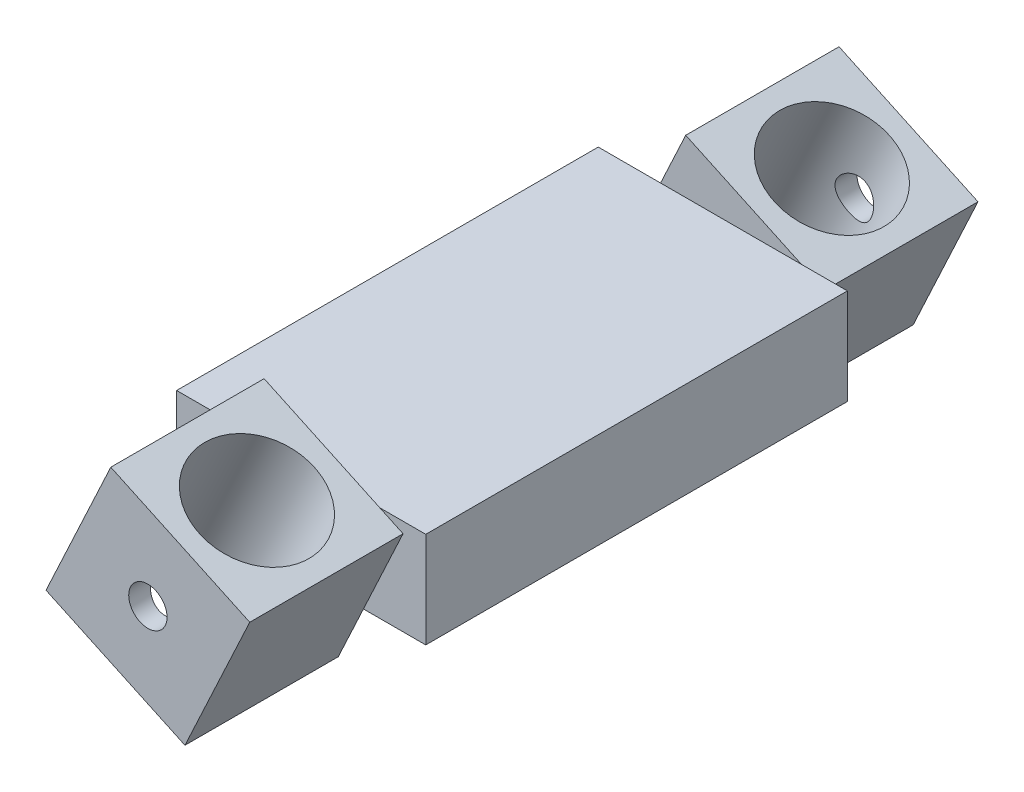
ISO-10303-21;
HEADER;
FILE_DESCRIPTION(('STEP AP214'),'2;1');
FILE_NAME('part.step','',(''),(''),'','','');
FILE_SCHEMA(('AUTOMOTIVE_DESIGN { 1 0 10303 214 1 1 1 1 }'));
ENDSEC;
DATA;
#1=APPLICATION_CONTEXT('core data for automotive mechanical design processes');
#2=APPLICATION_PROTOCOL_DEFINITION('international standard','automotive_design',2000,#1);
#3=PRODUCT_CONTEXT('',#1,'mechanical');
#4=PRODUCT('Part','Part','',(#3));
#5=PRODUCT_RELATED_PRODUCT_CATEGORY('part','',(#4));
#6=PRODUCT_DEFINITION_FORMATION('','',#4);
#7=PRODUCT_DEFINITION_CONTEXT('part definition',#1,'design');
#8=PRODUCT_DEFINITION('design','',#6,#7);
#9=PRODUCT_DEFINITION_SHAPE('','',#8);
#10=(LENGTH_UNIT() NAMED_UNIT(*) SI_UNIT(.MILLI.,.METRE.));
#11=(NAMED_UNIT(*) PLANE_ANGLE_UNIT() SI_UNIT($,.RADIAN.));
#12=(NAMED_UNIT(*) SI_UNIT($,.STERADIAN.) SOLID_ANGLE_UNIT());
#13=UNCERTAINTY_MEASURE_WITH_UNIT(LENGTH_MEASURE(1.E-05),#10,'distance_accuracy_value','');
#14=(GEOMETRIC_REPRESENTATION_CONTEXT(3) GLOBAL_UNCERTAINTY_ASSIGNED_CONTEXT((#13)) GLOBAL_UNIT_ASSIGNED_CONTEXT((#10,
#11,#12)) REPRESENTATION_CONTEXT('',''));
#15=CARTESIAN_POINT('',(0.,0.,0.));
#16=DIRECTION('',(0.,0.,1.));
#17=DIRECTION('',(1.,0.,0.));
#18=AXIS2_PLACEMENT_3D('',#15,#16,#17);
#19=CARTESIAN_POINT('',(3.38094609392562,7.25046229629318,8.));
#20=DIRECTION('',(-0.906307787036648,0.422618261740703,0.));
#21=DIRECTION('',(-0.422618261740703,-0.906307787036648,0.));
#22=AXIS2_PLACEMENT_3D('',#19,#20,#21);
#23=PLANE('',#22);
#24=DIRECTION('',(-0.422618261740703,-0.906307787036648,0.));
#25=VECTOR('',#24,1.);
#26=CARTESIAN_POINT('',(3.38094609392562,7.25046229629318,8.));
#27=LINE('',#26,#25);
#28=CARTESIAN_POINT('',(3.38094609392562,7.25046229629318,8.));
#29=VERTEX_POINT('',#28);
#30=CARTESIAN_POINT('',(1.31298442927868,2.8157041951094,8.));
#31=VERTEX_POINT('',#30);
#32=EDGE_CURVE('E133',#29,#31,#27,.T.);
#33=ORIENTED_EDGE('',*,*,#32,.T.);
#34=DIRECTION('',(0.422618261740703,0.906307787036648,0.));
#35=VECTOR('',#34,1.);
#36=CARTESIAN_POINT('',(3.38094609392562,7.25046229629318,8.));
#37=LINE('',#36,#35);
#38=CARTESIAN_POINT('',(0.,0.,8.));
#39=VERTEX_POINT('',#38);
#40=EDGE_CURVE('E85',#39,#31,#37,.T.);
#41=ORIENTED_EDGE('',*,*,#40,.F.);
#42=DIRECTION('',(0.,0.,-1.));
#43=VECTOR('',#42,1.);
#44=CARTESIAN_POINT('',(0.,0.,8.));
#45=LINE('',#44,#43);
#46=CARTESIAN_POINT('',(0.,0.,0.));
#47=VERTEX_POINT('',#46);
#48=EDGE_CURVE('E79',#39,#47,#45,.T.);
#49=ORIENTED_EDGE('',*,*,#48,.T.);
#50=DIRECTION('',(0.422618261740703,0.906307787036648,0.));
#51=VECTOR('',#50,1.);
#52=CARTESIAN_POINT('',(3.38094609392562,7.25046229629318,0.));
#53=LINE('',#52,#51);
#54=CARTESIAN_POINT('',(3.38094609392562,7.25046229629318,0.));
#55=VERTEX_POINT('',#54);
#56=EDGE_CURVE('E92',#47,#55,#53,.T.);
#57=ORIENTED_EDGE('',*,*,#56,.T.);
#58=DIRECTION('',(0.,0.,-1.));
#59=VECTOR('',#58,1.);
#60=CARTESIAN_POINT('',(3.38094609392562,7.25046229629318,8.));
#61=LINE('',#60,#59);
#62=EDGE_CURVE('E11',#29,#55,#61,.T.);
#63=ORIENTED_EDGE('',*,*,#62,.F.);
#64=EDGE_LOOP('',(#33,#41,#49,#57,#63));
#65=FACE_BOUND('',#64,.T.);
#66=ADVANCED_FACE('F39',(#65),#23,.F.);
#67=CARTESIAN_POINT('',(-3.86951620236756,10.6314083902188,8.));
#68=DIRECTION('',(-0.422618261740703,-0.906307787036648,0.));
#69=DIRECTION('',(0.906307787036648,-0.422618261740703,0.));
#70=AXIS2_PLACEMENT_3D('',#67,#68,#69);
#71=PLANE('',#70);
#72=CARTESIAN_POINT('',(-0.244285054220961,8.94093534325599,4.));
#73=DIRECTION('',(0.422618261740703,0.906307787036648,0.));
#74=DIRECTION('',(-0.906307787036648,0.422618261740703,0.));
#75=AXIS2_PLACEMENT_3D('',#72,#73,#74);
#76=CIRCLE('',#75,3.);
#77=CARTESIAN_POINT('',(-2.96320841533091,10.2087901284781,4.));
#78=VERTEX_POINT('',#77);
#79=EDGE_CURVE('E374',#78,#78,#76,.T.);
#80=ORIENTED_EDGE('',*,*,#79,.F.);
#81=EDGE_LOOP('',(#80));
#82=FACE_BOUND('',#81,.T.);
#83=DIRECTION('',(0.906307787036648,-0.422618261740703,0.));
#84=VECTOR('',#83,1.);
#85=CARTESIAN_POINT('',(2.16878093015228,7.8157041951094,8.));
#86=LINE('',#85,#84);
#87=CARTESIAN_POINT('',(2.16878093015228,7.8157041951094,8.));
#88=VERTEX_POINT('',#87);
#89=EDGE_CURVE('E130',#88,#29,#86,.T.);
#90=ORIENTED_EDGE('',*,*,#89,.T.);
#91=ORIENTED_EDGE('',*,*,#62,.T.);
#92=DIRECTION('',(-0.906307787036648,0.422618261740703,0.));
#93=VECTOR('',#92,1.);
#94=CARTESIAN_POINT('',(-3.86951620236756,10.6314083902188,0.));
#95=LINE('',#94,#93);
#96=CARTESIAN_POINT('',(-3.86951620236756,10.6314083902188,0.));
#97=VERTEX_POINT('',#96);
#98=EDGE_CURVE('E97',#55,#97,#95,.T.);
#99=ORIENTED_EDGE('',*,*,#98,.T.);
#100=DIRECTION('',(0.,0.,-1.));
#101=VECTOR('',#100,1.);
#102=CARTESIAN_POINT('',(-3.86951620236756,10.6314083902188,8.));
#103=LINE('',#102,#101);
#104=CARTESIAN_POINT('',(-3.86951620236756,10.6314083902188,8.));
#105=VERTEX_POINT('',#104);
#106=EDGE_CURVE('E48',#105,#97,#103,.T.);
#107=ORIENTED_EDGE('',*,*,#106,.F.);
#108=DIRECTION('',(-0.906307787036648,0.422618261740703,0.));
#109=VECTOR('',#108,1.);
#110=CARTESIAN_POINT('',(-3.86951620236756,10.6314083902188,8.));
#111=LINE('',#110,#109);
#112=EDGE_CURVE('E127',#88,#105,#111,.T.);
#113=ORIENTED_EDGE('',*,*,#112,.F.);
#114=EDGE_LOOP('',(#90,#91,#99,#107,#113));
#115=FACE_BOUND('',#114,.T.);
#116=ADVANCED_FACE('F125',(#82,#115),#71,.F.);
#117=CARTESIAN_POINT('',(-7.25046229629319,3.38094609392563,8.));
#118=DIRECTION('',(0.906307787036648,-0.422618261740704,0.));
#119=DIRECTION('',(0.422618261740704,0.906307787036648,0.));
#120=AXIS2_PLACEMENT_3D('',#117,#118,#119);
#121=PLANE('',#120);
#122=DIRECTION('',(0.422618261740704,0.906307787036648,0.));
#123=VECTOR('',#122,1.);
#124=CARTESIAN_POINT('',(-7.25046229629319,3.38094609392563,8.));
#125=LINE('',#124,#123);
#126=CARTESIAN_POINT('',(-7.25046229629319,3.38094609392563,8.));
#127=VERTEX_POINT('',#126);
#128=CARTESIAN_POINT('',(-5.18250063164625,7.8157041951094,8.));
#129=VERTEX_POINT('',#128);
#130=EDGE_CURVE('E172',#127,#129,#125,.T.);
#131=ORIENTED_EDGE('',*,*,#130,.T.);
#132=DIRECTION('',(-0.422618261740704,-0.906307787036648,0.));
#133=VECTOR('',#132,1.);
#134=CARTESIAN_POINT('',(-7.25046229629319,3.38094609392563,8.));
#135=LINE('',#134,#133);
#136=EDGE_CURVE('E121',#105,#129,#135,.T.);
#137=ORIENTED_EDGE('',*,*,#136,.F.);
#138=ORIENTED_EDGE('',*,*,#106,.T.);
#139=DIRECTION('',(-0.422618261740704,-0.906307787036648,0.));
#140=VECTOR('',#139,1.);
#141=CARTESIAN_POINT('',(-7.25046229629319,3.38094609392563,0.));
#142=LINE('',#141,#140);
#143=CARTESIAN_POINT('',(-7.25046229629319,3.38094609392563,0.));
#144=VERTEX_POINT('',#143);
#145=EDGE_CURVE('E86',#97,#144,#142,.T.);
#146=ORIENTED_EDGE('',*,*,#145,.T.);
#147=DIRECTION('',(0.,0.,-1.));
#148=VECTOR('',#147,1.);
#149=CARTESIAN_POINT('',(-7.25046229629319,3.38094609392563,8.));
#150=LINE('',#149,#148);
#151=EDGE_CURVE('E73',#127,#144,#150,.T.);
#152=ORIENTED_EDGE('',*,*,#151,.F.);
#153=EDGE_LOOP('',(#131,#137,#138,#146,#152));
#154=FACE_BOUND('',#153,.T.);
#155=ADVANCED_FACE('F119',(#154),#121,.F.);
#156=CARTESIAN_POINT('',(0.,0.,8.));
#157=DIRECTION('',(0.422618261740703,0.906307787036648,0.));
#158=DIRECTION('',(-0.906307787036648,0.422618261740703,0.));
#159=AXIS2_PLACEMENT_3D('',#156,#157,#158);
#160=PLANE('',#159);
#161=CARTESIAN_POINT('',(-3.62523114814659,1.69047304696281,4.));
#162=DIRECTION('',(0.422618261740703,0.906307787036648,0.));
#163=DIRECTION('',(-0.906307787036648,0.422618261740703,0.));
#164=AXIS2_PLACEMENT_3D('',#161,#162,#163);
#165=CIRCLE('',#164,3.);
#166=CARTESIAN_POINT('',(-6.34415450925653,2.95832783218492,4.));
#167=VERTEX_POINT('',#166);
#168=EDGE_CURVE('E362',#167,#167,#165,.F.);
#169=ORIENTED_EDGE('',*,*,#168,.F.);
#170=EDGE_LOOP('',(#169));
#171=FACE_BOUND('',#170,.T.);
#172=DIRECTION('',(-0.906307787036648,0.422618261740703,0.));
#173=VECTOR('',#172,1.);
#174=CARTESIAN_POINT('',(-6.03829713251985,2.8157041951094,8.));
#175=LINE('',#174,#173);
#176=CARTESIAN_POINT('',(-6.03829713251985,2.8157041951094,8.));
#177=VERTEX_POINT('',#176);
#178=EDGE_CURVE('E218',#177,#127,#175,.T.);
#179=ORIENTED_EDGE('',*,*,#178,.T.);
#180=ORIENTED_EDGE('',*,*,#151,.T.);
#181=DIRECTION('',(0.906307787036648,-0.422618261740703,0.));
#182=VECTOR('',#181,1.);
#183=CARTESIAN_POINT('',(0.,0.,0.));
#184=LINE('',#183,#182);
#185=EDGE_CURVE('E76',#144,#47,#184,.T.);
#186=ORIENTED_EDGE('',*,*,#185,.T.);
#187=ORIENTED_EDGE('',*,*,#48,.F.);
#188=DIRECTION('',(0.906307787036648,-0.422618261740703,0.));
#189=VECTOR('',#188,1.);
#190=CARTESIAN_POINT('',(0.,0.,8.));
#191=LINE('',#190,#189);
#192=EDGE_CURVE('E56',#177,#39,#191,.T.);
#193=ORIENTED_EDGE('',*,*,#192,.F.);
#194=EDGE_LOOP('',(#179,#180,#186,#187,#193));
#195=FACE_BOUND('',#194,.T.);
#196=ADVANCED_FACE('F78',(#171,#195),#160,.F.);
#197=CARTESIAN_POINT('',(0.,0.,8.));
#198=DIRECTION('',(0.,0.,-1.));
#199=DIRECTION('',(-1.,0.,0.));
#200=AXIS2_PLACEMENT_3D('',#197,#198,#199);
#201=PLANE('',#200);
#202=DIRECTION('',(-1.,0.,0.));
#203=VECTOR('',#202,1.);
#204=CARTESIAN_POINT('',(2.16878093015228,7.8157041951094,8.));
#205=LINE('',#204,#203);
#206=EDGE_CURVE('E99',#88,#129,#205,.T.);
#207=ORIENTED_EDGE('',*,*,#206,.F.);
#208=ORIENTED_EDGE('',*,*,#112,.T.);
#209=ORIENTED_EDGE('',*,*,#136,.T.);
#210=EDGE_LOOP('',(#207,#208,#209));
#211=FACE_BOUND('',#210,.T.);
#212=ADVANCED_FACE('F185',(#211),#201,.F.);
#213=DIRECTION('',(1.,0.,0.));
#214=VECTOR('',#213,1.);
#215=CARTESIAN_POINT('',(-6.03829713251985,2.8157041951094,8.));
#216=LINE('',#215,#214);
#217=EDGE_CURVE('E105',#177,#31,#216,.T.);
#218=ORIENTED_EDGE('',*,*,#217,.F.);
#219=ORIENTED_EDGE('',*,*,#192,.T.);
#220=ORIENTED_EDGE('',*,*,#40,.T.);
#221=EDGE_LOOP('',(#218,#219,#220));
#222=FACE_BOUND('',#221,.T.);
#223=ADVANCED_FACE('F238',(#222),#201,.F.);
#224=CARTESIAN_POINT('',(0.,0.,0.));
#225=DIRECTION('',(0.,0.,-1.));
#226=DIRECTION('',(-1.,0.,0.));
#227=AXIS2_PLACEMENT_3D('',#224,#225,#226);
#228=PLANE('',#227);
#229=CARTESIAN_POINT('',(-1.93475810118378,5.3157041951094,0.));
#230=DIRECTION('',(0.,0.,-1.));
#231=DIRECTION('',(-1.,0.,0.));
#232=AXIS2_PLACEMENT_3D('',#229,#230,#231);
#233=CIRCLE('',#232,1.);
#234=CARTESIAN_POINT('',(-2.93475810118378,5.3157041951094,0.));
#235=VERTEX_POINT('',#234);
#236=EDGE_CURVE('E201',#235,#235,#233,.T.);
#237=ORIENTED_EDGE('',*,*,#236,.F.);
#238=EDGE_LOOP('',(#237));
#239=FACE_BOUND('',#238,.T.);
#240=ORIENTED_EDGE('',*,*,#56,.F.);
#241=ORIENTED_EDGE('',*,*,#185,.F.);
#242=ORIENTED_EDGE('',*,*,#145,.F.);
#243=ORIENTED_EDGE('',*,*,#98,.F.);
#244=EDGE_LOOP('',(#240,#241,#242,#243));
#245=FACE_BOUND('',#244,.T.);
#246=ADVANCED_FACE('F96',(#239,#245),#228,.T.);
#247=CARTESIAN_POINT('',(-6.03829713251985,2.8157041951094,19.));
#248=DIRECTION('',(0.,1.,0.));
#249=DIRECTION('',(-1.,0.,0.));
#250=AXIS2_PLACEMENT_3D('',#247,#248,#249);
#251=PLANE('',#250);
#252=ORIENTED_EDGE('',*,*,#217,.T.);
#253=DIRECTION('',(1.,0.,0.));
#254=VECTOR('',#253,1.);
#255=CARTESIAN_POINT('',(1.31298442927868,2.8157041951094,8.));
#256=LINE('',#255,#254);
#257=CARTESIAN_POINT('',(4.56524189881622,2.8157041951094,8.));
#258=VERTEX_POINT('',#257);
#259=EDGE_CURVE('E208',#31,#258,#256,.T.);
#260=ORIENTED_EDGE('',*,*,#259,.T.);
#261=DIRECTION('',(0.,0.,-1.));
#262=VECTOR('',#261,1.);
#263=CARTESIAN_POINT('',(4.56524189881622,2.8157041951094,24.9646608158522));
#264=LINE('',#263,#262);
#265=CARTESIAN_POINT('',(4.56524189881622,2.8157041951094,30.));
#266=VERTEX_POINT('',#265);
#267=EDGE_CURVE('E207',#266,#258,#264,.T.);
#268=ORIENTED_EDGE('',*,*,#267,.F.);
#269=DIRECTION('',(1.,0.,0.));
#270=VECTOR('',#269,1.);
#271=CARTESIAN_POINT('',(1.31298442927868,2.8157041951094,30.));
#272=LINE('',#271,#270);
#273=CARTESIAN_POINT('',(1.31298442927868,2.8157041951094,30.));
#274=VERTEX_POINT('',#273);
#275=EDGE_CURVE('E705',#274,#266,#272,.T.);
#276=ORIENTED_EDGE('',*,*,#275,.F.);
#277=DIRECTION('',(1.,0.,0.));
#278=VECTOR('',#277,1.);
#279=CARTESIAN_POINT('',(-6.03829713251985,2.8157041951094,30.));
#280=LINE('',#279,#278);
#281=CARTESIAN_POINT('',(-6.03829713251985,2.8157041951094,30.));
#282=VERTEX_POINT('',#281);
#283=EDGE_CURVE('E317',#282,#274,#280,.T.);
#284=ORIENTED_EDGE('',*,*,#283,.F.);
#285=DIRECTION('',(1.,0.,0.));
#286=VECTOR('',#285,1.);
#287=CARTESIAN_POINT('',(-6.03829713251985,2.8157041951094,30.));
#288=LINE('',#287,#286);
#289=CARTESIAN_POINT('',(-8.43475810118378,2.8157041951094,30.));
#290=VERTEX_POINT('',#289);
#291=EDGE_CURVE('E247',#290,#282,#288,.T.);
#292=ORIENTED_EDGE('',*,*,#291,.F.);
#293=DIRECTION('',(0.,0.,-1.));
#294=VECTOR('',#293,1.);
#295=CARTESIAN_POINT('',(-8.43475810118378,2.8157041951094,24.9646608158522));
#296=LINE('',#295,#294);
#297=CARTESIAN_POINT('',(-8.43475810118378,2.8157041951094,8.));
#298=VERTEX_POINT('',#297);
#299=EDGE_CURVE('E224',#290,#298,#296,.T.);
#300=ORIENTED_EDGE('',*,*,#299,.T.);
#301=DIRECTION('',(1.,0.,0.));
#302=VECTOR('',#301,1.);
#303=CARTESIAN_POINT('',(-6.03829713251985,2.8157041951094,8.));
#304=LINE('',#303,#302);
#305=EDGE_CURVE('E221',#298,#177,#304,.T.);
#306=ORIENTED_EDGE('',*,*,#305,.T.);
#307=EDGE_LOOP('',(#252,#260,#268,#276,#284,#292,#300,#306));
#308=FACE_BOUND('',#307,.T.);
#309=ADVANCED_FACE('F240',(#308),#251,.F.);
#310=CARTESIAN_POINT('',(2.16878093015228,7.8157041951094,19.));
#311=DIRECTION('',(0.,-1.,0.));
#312=DIRECTION('',(0.,0.,-1.));
#313=AXIS2_PLACEMENT_3D('',#310,#311,#312);
#314=PLANE('',#313);
#315=ORIENTED_EDGE('',*,*,#206,.T.);
#316=DIRECTION('',(-1.,0.,0.));
#317=VECTOR('',#316,1.);
#318=CARTESIAN_POINT('',(-5.18250063164625,7.8157041951094,8.));
#319=LINE('',#318,#317);
#320=CARTESIAN_POINT('',(-8.43475810118378,7.8157041951094,8.));
#321=VERTEX_POINT('',#320);
#322=EDGE_CURVE('E169',#129,#321,#319,.T.);
#323=ORIENTED_EDGE('',*,*,#322,.T.);
#324=DIRECTION('',(0.,0.,-1.));
#325=VECTOR('',#324,1.);
#326=CARTESIAN_POINT('',(-8.43475810118378,7.8157041951094,24.9646608158522));
#327=LINE('',#326,#325);
#328=CARTESIAN_POINT('',(-8.43475810118378,7.8157041951094,30.));
#329=VERTEX_POINT('',#328);
#330=EDGE_CURVE('E179',#329,#321,#327,.T.);
#331=ORIENTED_EDGE('',*,*,#330,.F.);
#332=DIRECTION('',(-1.,0.,0.));
#333=VECTOR('',#332,1.);
#334=CARTESIAN_POINT('',(-5.18250063164625,7.8157041951094,30.));
#335=LINE('',#334,#333);
#336=CARTESIAN_POINT('',(-5.18250063164625,7.8157041951094,30.));
#337=VERTEX_POINT('',#336);
#338=EDGE_CURVE('E258',#337,#329,#335,.T.);
#339=ORIENTED_EDGE('',*,*,#338,.F.);
#340=DIRECTION('',(-1.,0.,0.));
#341=VECTOR('',#340,1.);
#342=CARTESIAN_POINT('',(2.16878093015228,7.8157041951094,30.));
#343=LINE('',#342,#341);
#344=CARTESIAN_POINT('',(2.16878093015228,7.8157041951094,30.));
#345=VERTEX_POINT('',#344);
#346=EDGE_CURVE('E312',#345,#337,#343,.T.);
#347=ORIENTED_EDGE('',*,*,#346,.F.);
#348=DIRECTION('',(-1.,0.,0.));
#349=VECTOR('',#348,1.);
#350=CARTESIAN_POINT('',(4.56524189881622,7.8157041951094,30.));
#351=LINE('',#350,#349);
#352=CARTESIAN_POINT('',(4.56524189881622,7.8157041951094,30.));
#353=VERTEX_POINT('',#352);
#354=EDGE_CURVE('E693',#353,#345,#351,.T.);
#355=ORIENTED_EDGE('',*,*,#354,.F.);
#356=DIRECTION('',(0.,0.,-1.));
#357=VECTOR('',#356,1.);
#358=CARTESIAN_POINT('',(4.56524189881622,7.8157041951094,24.9646608158522));
#359=LINE('',#358,#357);
#360=CARTESIAN_POINT('',(4.56524189881622,7.8157041951094,8.));
#361=VERTEX_POINT('',#360);
#362=EDGE_CURVE('E192',#353,#361,#359,.T.);
#363=ORIENTED_EDGE('',*,*,#362,.T.);
#364=DIRECTION('',(-1.,0.,0.));
#365=VECTOR('',#364,1.);
#366=CARTESIAN_POINT('',(4.56524189881622,7.8157041951094,8.));
#367=LINE('',#366,#365);
#368=EDGE_CURVE('E189',#361,#88,#367,.T.);
#369=ORIENTED_EDGE('',*,*,#368,.T.);
#370=EDGE_LOOP('',(#315,#323,#331,#339,#347,#355,#363,#369));
#371=FACE_BOUND('',#370,.T.);
#372=ADVANCED_FACE('F187',(#371),#314,.F.);
#373=CARTESIAN_POINT('',(-8.43475810118378,2.8157041951094,24.9646608158522));
#374=DIRECTION('',(1.,0.,0.));
#375=DIRECTION('',(0.,0.,-1.));
#376=AXIS2_PLACEMENT_3D('',#373,#374,#375);
#377=PLANE('',#376);
#378=ORIENTED_EDGE('',*,*,#299,.F.);
#379=DIRECTION('',(0.,-1.,0.));
#380=VECTOR('',#379,1.);
#381=CARTESIAN_POINT('',(-8.43475810118378,2.8157041951094,30.));
#382=LINE('',#381,#380);
#383=EDGE_CURVE('E253',#329,#290,#382,.T.);
#384=ORIENTED_EDGE('',*,*,#383,.F.);
#385=ORIENTED_EDGE('',*,*,#330,.T.);
#386=DIRECTION('',(0.,-1.,0.));
#387=VECTOR('',#386,1.);
#388=CARTESIAN_POINT('',(-8.43475810118378,2.8157041951094,8.));
#389=LINE('',#388,#387);
#390=EDGE_CURVE('E175',#321,#298,#389,.T.);
#391=ORIENTED_EDGE('',*,*,#390,.T.);
#392=EDGE_LOOP('',(#378,#384,#385,#391));
#393=FACE_BOUND('',#392,.T.);
#394=ADVANCED_FACE('F251',(#393),#377,.F.);
#395=CARTESIAN_POINT('',(0.,0.,8.));
#396=DIRECTION('',(0.,0.,1.));
#397=DIRECTION('',(1.,0.,0.));
#398=AXIS2_PLACEMENT_3D('',#395,#396,#397);
#399=PLANE('',#398);
#400=ORIENTED_EDGE('',*,*,#130,.F.);
#401=ORIENTED_EDGE('',*,*,#178,.F.);
#402=ORIENTED_EDGE('',*,*,#305,.F.);
#403=ORIENTED_EDGE('',*,*,#390,.F.);
#404=ORIENTED_EDGE('',*,*,#322,.F.);
#405=EDGE_LOOP('',(#400,#401,#402,#403,#404));
#406=FACE_BOUND('',#405,.T.);
#407=ADVANCED_FACE('F170',(#406),#399,.F.);
#408=CARTESIAN_POINT('',(4.56524189881622,2.8157041951094,24.9646608158522));
#409=DIRECTION('',(-1.,0.,0.));
#410=DIRECTION('',(0.,0.,1.));
#411=AXIS2_PLACEMENT_3D('',#408,#409,#410);
#412=PLANE('',#411);
#413=ORIENTED_EDGE('',*,*,#362,.F.);
#414=DIRECTION('',(0.,1.,0.));
#415=VECTOR('',#414,1.);
#416=CARTESIAN_POINT('',(4.56524189881622,2.8157041951094,30.));
#417=LINE('',#416,#415);
#418=EDGE_CURVE('E699',#266,#353,#417,.T.);
#419=ORIENTED_EDGE('',*,*,#418,.F.);
#420=ORIENTED_EDGE('',*,*,#267,.T.);
#421=DIRECTION('',(0.,1.,0.));
#422=VECTOR('',#421,1.);
#423=CARTESIAN_POINT('',(4.56524189881622,2.8157041951094,8.));
#424=LINE('',#423,#422);
#425=EDGE_CURVE('E204',#258,#361,#424,.T.);
#426=ORIENTED_EDGE('',*,*,#425,.T.);
#427=EDGE_LOOP('',(#413,#419,#420,#426));
#428=FACE_BOUND('',#427,.T.);
#429=ADVANCED_FACE('F446',(#428),#412,.F.);
#430=CARTESIAN_POINT('',(0.,0.,8.));
#431=DIRECTION('',(0.,0.,1.));
#432=DIRECTION('',(1.,0.,0.));
#433=AXIS2_PLACEMENT_3D('',#430,#431,#432);
#434=PLANE('',#433);
#435=ORIENTED_EDGE('',*,*,#32,.F.);
#436=ORIENTED_EDGE('',*,*,#89,.F.);
#437=ORIENTED_EDGE('',*,*,#368,.F.);
#438=ORIENTED_EDGE('',*,*,#425,.F.);
#439=ORIENTED_EDGE('',*,*,#259,.F.);
#440=EDGE_LOOP('',(#435,#436,#437,#438,#439));
#441=FACE_BOUND('',#440,.T.);
#442=ADVANCED_FACE('F197',(#441),#434,.F.);
#443=CARTESIAN_POINT('',(-1.93475810118378,5.3157041951094,4.));
#444=DIRECTION('',(0.,0.,-1.));
#445=DIRECTION('',(-1.,0.,0.));
#446=AXIS2_PLACEMENT_3D('',#443,#444,#445);
#447=CYLINDRICAL_SURFACE('',#446,1.);
#448=CARTESIAN_POINT('',(-2.93475810118378,5.3157041951094,1.14017374738312));
#449=CARTESIAN_POINT('',(-2.93475864990779,5.36917819681442,1.14733553557993));
#450=CARTESIAN_POINT('',(-2.93046120091182,5.42277127116053,1.15356858443858));
#451=CARTESIAN_POINT('',(-2.91326425363279,5.52878994586253,1.16346284797238));
#452=CARTESIAN_POINT('',(-2.90036987198543,5.581216221494,1.16712558975711));
#453=CARTESIAN_POINT('',(-2.86623014781804,5.68349540957464,1.17143631815716));
#454=CARTESIAN_POINT('',(-2.84497297085371,5.73334456145468,1.17208001567776));
#455=CARTESIAN_POINT('',(-2.79471685993221,5.82891576397315,1.17025915090065));
#456=CARTESIAN_POINT('',(-2.76571721747062,5.87463743639788,1.16779430406659));
#457=CARTESIAN_POINT('',(-2.70138356625217,5.95998505251699,1.16012626346611));
#458=CARTESIAN_POINT('',(-2.66615529292929,5.99969487369932,1.15496633407373));
#459=CARTESIAN_POINT('',(-2.59007380416502,6.07290307665939,1.14252894985464));
#460=CARTESIAN_POINT('',(-2.54921945814865,6.10640020679643,1.13525106909164));
#461=CARTESIAN_POINT('',(-2.46130043818123,6.16760203289099,1.11905383039535));
#462=CARTESIAN_POINT('',(-2.4140589879412,6.19503884318024,1.1100826835325));
#463=CARTESIAN_POINT('',(-2.31581924083264,6.24185485143122,1.09165740987211));
#464=CARTESIAN_POINT('',(-2.2648198804218,6.26123175793465,1.08220314657955));
#465=CARTESIAN_POINT('',(-2.15793874439207,6.29213618765834,1.06337182842357));
#466=CARTESIAN_POINT('',(-2.10194074787957,6.30327754263592,1.05401678735724));
#467=CARTESIAN_POINT('',(-1.98862432210548,6.31587766203998,1.03687369396259));
#468=CARTESIAN_POINT('',(-1.9313060236186,6.3173373813206,1.02908548717826));
#469=CARTESIAN_POINT('',(-1.81778716589613,6.31044246446438,1.01604942064311));
#470=CARTESIAN_POINT('',(-1.76158230011514,6.30222704492345,1.01076702347563));
#471=CARTESIAN_POINT('',(-1.65119283199194,6.27632992630914,1.0031860499227));
#472=CARTESIAN_POINT('',(-1.59700752802854,6.25865154820178,1.00088642771966));
#473=CARTESIAN_POINT('',(-1.49485374122448,6.2153799113696,0.999568508284584));
#474=CARTESIAN_POINT('',(-1.44671284559449,6.1901970031326,1.00040129287356));
#475=CARTESIAN_POINT('',(-1.35523611627108,6.1324535894443,1.00492650105571));
#476=CARTESIAN_POINT('',(-1.31190008268957,6.09989339106887,1.00861880563832));
#477=CARTESIAN_POINT('',(-1.23157221921439,6.02871498272164,1.01842790103737));
#478=CARTESIAN_POINT('',(-1.19452622201755,5.99015462534658,1.02452231263632));
#479=CARTESIAN_POINT('',(-1.1271644869485,5.90783824394151,1.03852551241755));
#480=CARTESIAN_POINT('',(-1.09685014759119,5.86408114317068,1.0464346769256));
#481=CARTESIAN_POINT('',(-1.04250931769223,5.77060305287296,1.06364607324206));
#482=CARTESIAN_POINT('',(-1.01879011655407,5.72071149933357,1.07299200039939));
#483=CARTESIAN_POINT('',(-0.979869221656484,5.61772913528381,1.09185240487969));
#484=CARTESIAN_POINT('',(-0.964669965167039,5.56463741411859,1.10136692963058));
#485=CARTESIAN_POINT('',(-0.942819603857798,5.45465630473434,1.11986801715037));
#486=CARTESIAN_POINT('',(-0.936481962820007,5.3976990830844,1.1288249835745));
#487=CARTESIAN_POINT('',(-0.933648172110955,5.28326083897813,1.14475404878013));
#488=CARTESIAN_POINT('',(-0.937149690163241,5.22577994387297,1.15172661751222));
#489=CARTESIAN_POINT('',(-0.953818565255692,5.11348067255937,1.16263448681165));
#490=CARTESIAN_POINT('',(-0.9667308482968,5.05863197534959,1.16664442166105));
#491=CARTESIAN_POINT('',(-1.00164234573636,4.95176493054454,1.17138570082086));
#492=CARTESIAN_POINT('',(-1.02363823971457,4.89974555657456,1.17211824199202));
#493=CARTESIAN_POINT('',(-1.07472446724624,4.80267259698163,1.1702566580584));
#494=CARTESIAN_POINT('',(-1.10340929769589,4.75740158064745,1.16782555994089));
#495=CARTESIAN_POINT('',(-1.16749437993188,4.67215906718952,1.16021719526934));
#496=CARTESIAN_POINT('',(-1.20289518060273,4.6321880036756,1.15503970419524));
#497=CARTESIAN_POINT('',(-1.27965136228827,4.55827787667292,1.14249756315251));
#498=CARTESIAN_POINT('',(-1.3210465872892,4.52438287089812,1.13511789683461));
#499=CARTESIAN_POINT('',(-1.40851835684369,4.46370232231959,1.11899292703232));
#500=CARTESIAN_POINT('',(-1.45459619565347,4.43691875251955,1.11024724562606));
#501=CARTESIAN_POINT('',(-1.55284044146405,4.38982168603956,1.09181499362265));
#502=CARTESIAN_POINT('',(-1.60519901520622,4.36991817245228,1.08210314145819));
#503=CARTESIAN_POINT('',(-1.71259710491996,4.33909458964935,1.06320399544024));
#504=CARTESIAN_POINT('',(-1.76763703516122,4.32817591328352,1.05401678312296));
#505=CARTESIAN_POINT('',(-1.88003805090925,4.31557367055957,1.03699355327296));
#506=CARTESIAN_POINT('',(-1.93742322251253,4.31406409313114,1.02918557236344));
#507=CARTESIAN_POINT('',(-2.0518820875337,4.32093487732268,1.01602226815266));
#508=CARTESIAN_POINT('',(-2.10895587429588,4.32931209059733,1.0106661648302));
#509=CARTESIAN_POINT('',(-2.21879855819315,4.35529819718839,1.00318386718311));
#510=CARTESIAN_POINT('',(-2.27164846546296,4.3725301813795,1.00093867895183));
#511=CARTESIAN_POINT('',(-2.3737928479915,4.41552793757022,0.99954022574925));
#512=CARTESIAN_POINT('',(-2.42308805873437,4.44129193804875,1.00038631929397));
#513=CARTESIAN_POINT('',(-2.51499675212469,4.4995056999125,1.00499083149581));
#514=CARTESIAN_POINT('',(-2.55778297067106,4.53169182960197,1.00864695859773));
#515=CARTESIAN_POINT('',(-2.6375304601626,4.60229821256565,1.01836967892051));
#516=CARTESIAN_POINT('',(-2.67449151411808,4.64071869796392,1.02443636190591));
#517=CARTESIAN_POINT('',(-2.74237749751609,4.72352736296213,1.03851313776915));
#518=CARTESIAN_POINT('',(-2.77317073493308,4.76801726325302,1.04655880502516));
#519=CARTESIAN_POINT('',(-2.8271448237788,4.86122667371555,1.06372668726133));
#520=CARTESIAN_POINT('',(-2.85032108365637,4.90994871275261,1.07284954709157));
#521=CARTESIAN_POINT('',(-2.89093000128599,5.01672362354841,1.09241581231923));
#522=CARTESIAN_POINT('',(-2.90728990420165,5.07518335923296,1.10288234786801));
#523=CARTESIAN_POINT('',(-2.92920245079895,5.19427915677427,1.12269041683085));
#524=CARTESIAN_POINT('',(-2.93475747739213,5.25491473576476,1.13203219787226));
#525=CARTESIAN_POINT('',(-2.93475810118378,5.3157041951094,1.14017374738312));
#526=B_SPLINE_CURVE_WITH_KNOTS('',3,(#448,#449,#450,#451,#452,#453,#454,#455,#456,#457,#458,
#459,#460,#461,#462,#463,#464,#465,#466,#467,#468,#469,#470,#471,#472,#473,#474,#475,#476,#477,
#478,#479,#480,#481,#482,#483,#484,#485,#486,#487,#488,#489,#490,#491,#492,#493,#494,#495,#496,
#497,#498,#499,#500,#501,#502,#503,#504,#505,#506,#507,#508,#509,#510,#511,#512,#513,#514,#515,
#516,#517,#518,#519,#520,#521,#522,#523,#524,#525),.UNSPECIFIED.,.T.,.F.,(4,2,2,2,2,2,2,2,2,2,2,
2,2,2,2,2,2,2,2,2,2,2,2,2,2,2,2,2,2,2,2,2,2,2,2,2,2,2,4),(0.,0.161655015818573,
0.323213905219895,0.485002248663138,0.646805402255713,0.80608751208361,0.965401676930054,
1.1307583761686,1.29616205480478,1.46890026673539,1.64162144205609,1.81188737714579,
1.98209359761065,2.14431257632067,2.30652480399007,2.46726020816788,2.62802897425961,
2.7953622930033,2.9627434557919,3.13590731952647,3.30903013992319,3.47762724183347,
3.64616276928729,3.80634792018175,3.96654616837313,4.12786276922688,4.28922407925877,
4.4589956359671,4.62879350609124,4.80172211039915,4.97459566225268,5.14065491195209,
5.30667970400402,5.46693141596756,5.62718909596036,5.79057036808667,5.95404994736616,
6.13786055916769,6.32163062870857),.UNSPECIFIED.);
#527=CARTESIAN_POINT('',(-2.93475810118378,5.3157041951094,1.14017374738312));
#528=VERTEX_POINT('',#527);
#529=EDGE_CURVE('E366',#528,#528,#526,.T.);
#530=ORIENTED_EDGE('',*,*,#529,.F.);
#531=EDGE_LOOP('',(#530));
#532=FACE_BOUND('',#531,.T.);
#533=ORIENTED_EDGE('',*,*,#236,.T.);
#534=EDGE_LOOP('',(#533));
#535=FACE_BOUND('',#534,.T.);
#536=ADVANCED_FACE('F334',(#532,#535),#447,.F.);
#537=CARTESIAN_POINT('',(3.38094609392562,7.25046229629318,30.));
#538=DIRECTION('',(-0.906307787036648,0.422618261740703,0.));
#539=DIRECTION('',(-0.422618261740703,-0.906307787036648,0.));
#540=AXIS2_PLACEMENT_3D('',#537,#538,#539);
#541=PLANE('',#540);
#542=DIRECTION('',(-0.422618261740703,-0.906307787036648,0.));
#543=VECTOR('',#542,1.);
#544=CARTESIAN_POINT('',(3.38094609392562,7.25046229629318,30.));
#545=LINE('',#544,#543);
#546=CARTESIAN_POINT('',(3.38094609392562,7.25046229629318,30.));
#547=VERTEX_POINT('',#546);
#548=EDGE_CURVE('E371',#547,#274,#545,.T.);
#549=ORIENTED_EDGE('',*,*,#548,.F.);
#550=DIRECTION('',(0.,0.,1.));
#551=VECTOR('',#550,1.);
#552=CARTESIAN_POINT('',(3.38094609392562,7.25046229629318,30.));
#553=LINE('',#552,#551);
#554=CARTESIAN_POINT('',(3.38094609392562,7.25046229629318,38.));
#555=VERTEX_POINT('',#554);
#556=EDGE_CURVE('E309',#547,#555,#553,.T.);
#557=ORIENTED_EDGE('',*,*,#556,.T.);
#558=DIRECTION('',(0.422618261740703,0.906307787036648,0.));
#559=VECTOR('',#558,1.);
#560=CARTESIAN_POINT('',(3.38094609392562,7.25046229629318,38.));
#561=LINE('',#560,#559);
#562=CARTESIAN_POINT('',(0.,0.,38.));
#563=VERTEX_POINT('',#562);
#564=EDGE_CURVE('E287',#563,#555,#561,.T.);
#565=ORIENTED_EDGE('',*,*,#564,.F.);
#566=DIRECTION('',(0.,0.,1.));
#567=VECTOR('',#566,1.);
#568=CARTESIAN_POINT('',(0.,0.,30.));
#569=LINE('',#568,#567);
#570=CARTESIAN_POINT('',(0.,0.,30.));
#571=VERTEX_POINT('',#570);
#572=EDGE_CURVE('E295',#571,#563,#569,.T.);
#573=ORIENTED_EDGE('',*,*,#572,.F.);
#574=DIRECTION('',(0.422618261740703,0.906307787036648,0.));
#575=VECTOR('',#574,1.);
#576=CARTESIAN_POINT('',(3.38094609392562,7.25046229629318,30.));
#577=LINE('',#576,#575);
#578=EDGE_CURVE('E292',#571,#274,#577,.T.);
#579=ORIENTED_EDGE('',*,*,#578,.T.);
#580=EDGE_LOOP('',(#549,#557,#565,#573,#579));
#581=FACE_BOUND('',#580,.T.);
#582=ADVANCED_FACE('F307',(#581),#541,.F.);
#583=CARTESIAN_POINT('',(-3.86951620236756,10.6314083902188,30.));
#584=DIRECTION('',(-0.422618261740703,-0.906307787036648,0.));
#585=DIRECTION('',(0.906307787036648,-0.422618261740703,0.));
#586=AXIS2_PLACEMENT_3D('',#583,#584,#585);
#587=PLANE('',#586);
#588=CARTESIAN_POINT('',(-0.244285054220961,8.94093534325599,34.));
#589=DIRECTION('',(0.422618261740703,0.906307787036648,0.));
#590=DIRECTION('',(-0.906307787036648,0.422618261740703,0.));
#591=AXIS2_PLACEMENT_3D('',#588,#589,#590);
#592=CIRCLE('',#591,3.);
#593=CARTESIAN_POINT('',(-2.96320841533091,10.2087901284781,34.));
#594=VERTEX_POINT('',#593);
#595=EDGE_CURVE('E383',#594,#594,#592,.T.);
#596=ORIENTED_EDGE('',*,*,#595,.F.);
#597=EDGE_LOOP('',(#596));
#598=FACE_BOUND('',#597,.T.);
#599=DIRECTION('',(0.906307787036648,-0.422618261740703,0.));
#600=VECTOR('',#599,1.);
#601=CARTESIAN_POINT('',(2.16878093015228,7.8157041951094,30.));
#602=LINE('',#601,#600);
#603=EDGE_CURVE('E683',#345,#547,#602,.T.);
#604=ORIENTED_EDGE('',*,*,#603,.F.);
#605=DIRECTION('',(-0.906307787036648,0.422618261740703,0.));
#606=VECTOR('',#605,1.);
#607=CARTESIAN_POINT('',(-3.86951620236756,10.6314083902188,30.));
#608=LINE('',#607,#606);
#609=CARTESIAN_POINT('',(-3.86951620236756,10.6314083902188,30.));
#610=VERTEX_POINT('',#609);
#611=EDGE_CURVE('E685',#345,#610,#608,.T.);
#612=ORIENTED_EDGE('',*,*,#611,.T.);
#613=DIRECTION('',(0.,0.,1.));
#614=VECTOR('',#613,1.);
#615=CARTESIAN_POINT('',(-3.86951620236756,10.6314083902188,30.));
#616=LINE('',#615,#614);
#617=CARTESIAN_POINT('',(-3.86951620236756,10.6314083902188,38.));
#618=VERTEX_POINT('',#617);
#619=EDGE_CURVE('E326',#610,#618,#616,.T.);
#620=ORIENTED_EDGE('',*,*,#619,.T.);
#621=DIRECTION('',(-0.906307787036648,0.422618261740703,0.));
#622=VECTOR('',#621,1.);
#623=CARTESIAN_POINT('',(-3.86951620236756,10.6314083902188,38.));
#624=LINE('',#623,#622);
#625=EDGE_CURVE('E311',#555,#618,#624,.T.);
#626=ORIENTED_EDGE('',*,*,#625,.F.);
#627=ORIENTED_EDGE('',*,*,#556,.F.);
#628=EDGE_LOOP('',(#604,#612,#620,#626,#627));
#629=FACE_BOUND('',#628,.T.);
#630=ADVANCED_FACE('F431',(#598,#629),#587,.F.);
#631=CARTESIAN_POINT('',(-7.25046229629319,3.38094609392563,30.));
#632=DIRECTION('',(0.906307787036648,-0.422618261740704,0.));
#633=DIRECTION('',(0.422618261740704,0.906307787036648,0.));
#634=AXIS2_PLACEMENT_3D('',#631,#632,#633);
#635=PLANE('',#634);
#636=DIRECTION('',(0.422618261740704,0.906307787036648,0.));
#637=VECTOR('',#636,1.);
#638=CARTESIAN_POINT('',(-7.25046229629319,3.38094609392563,30.));
#639=LINE('',#638,#637);
#640=CARTESIAN_POINT('',(-7.25046229629319,3.38094609392563,30.));
#641=VERTEX_POINT('',#640);
#642=EDGE_CURVE('E692',#641,#337,#639,.T.);
#643=ORIENTED_EDGE('',*,*,#642,.F.);
#644=DIRECTION('',(0.,0.,1.));
#645=VECTOR('',#644,1.);
#646=CARTESIAN_POINT('',(-7.25046229629319,3.38094609392563,30.));
#647=LINE('',#646,#645);
#648=CARTESIAN_POINT('',(-7.25046229629319,3.38094609392563,38.));
#649=VERTEX_POINT('',#648);
#650=EDGE_CURVE('E304',#641,#649,#647,.T.);
#651=ORIENTED_EDGE('',*,*,#650,.T.);
#652=DIRECTION('',(-0.422618261740704,-0.906307787036648,0.));
#653=VECTOR('',#652,1.);
#654=CARTESIAN_POINT('',(-7.25046229629319,3.38094609392563,38.));
#655=LINE('',#654,#653);
#656=EDGE_CURVE('E289',#618,#649,#655,.T.);
#657=ORIENTED_EDGE('',*,*,#656,.F.);
#658=ORIENTED_EDGE('',*,*,#619,.F.);
#659=DIRECTION('',(-0.422618261740704,-0.906307787036648,0.));
#660=VECTOR('',#659,1.);
#661=CARTESIAN_POINT('',(-7.25046229629319,3.38094609392563,30.));
#662=LINE('',#661,#660);
#663=EDGE_CURVE('E727',#610,#337,#662,.T.);
#664=ORIENTED_EDGE('',*,*,#663,.T.);
#665=EDGE_LOOP('',(#643,#651,#657,#658,#664));
#666=FACE_BOUND('',#665,.T.);
#667=ADVANCED_FACE('F422',(#666),#635,.F.);
#668=CARTESIAN_POINT('',(0.,0.,30.));
#669=DIRECTION('',(0.422618261740703,0.906307787036648,0.));
#670=DIRECTION('',(-0.906307787036648,0.422618261740703,0.));
#671=AXIS2_PLACEMENT_3D('',#668,#669,#670);
#672=PLANE('',#671);
#673=CARTESIAN_POINT('',(-3.62523114814659,1.69047304696281,34.));
#674=DIRECTION('',(0.422618261740703,0.906307787036648,0.));
#675=DIRECTION('',(-0.906307787036648,0.422618261740703,0.));
#676=AXIS2_PLACEMENT_3D('',#673,#674,#675);
#677=CIRCLE('',#676,3.);
#678=CARTESIAN_POINT('',(-6.34415450925653,2.95832783218492,34.));
#679=VERTEX_POINT('',#678);
#680=EDGE_CURVE('E396',#679,#679,#677,.F.);
#681=ORIENTED_EDGE('',*,*,#680,.F.);
#682=EDGE_LOOP('',(#681));
#683=FACE_BOUND('',#682,.T.);
#684=DIRECTION('',(-0.906307787036648,0.422618261740703,0.));
#685=VECTOR('',#684,1.);
#686=CARTESIAN_POINT('',(-6.03829713251985,2.8157041951094,30.));
#687=LINE('',#686,#685);
#688=EDGE_CURVE('E711',#282,#641,#687,.T.);
#689=ORIENTED_EDGE('',*,*,#688,.F.);
#690=DIRECTION('',(0.906307787036648,-0.422618261740703,0.));
#691=VECTOR('',#690,1.);
#692=CARTESIAN_POINT('',(0.,0.,30.));
#693=LINE('',#692,#691);
#694=EDGE_CURVE('E299',#282,#571,#693,.T.);
#695=ORIENTED_EDGE('',*,*,#694,.T.);
#696=ORIENTED_EDGE('',*,*,#572,.T.);
#697=DIRECTION('',(0.906307787036648,-0.422618261740703,0.));
#698=VECTOR('',#697,1.);
#699=CARTESIAN_POINT('',(0.,0.,38.));
#700=LINE('',#699,#698);
#701=EDGE_CURVE('E280',#649,#563,#700,.T.);
#702=ORIENTED_EDGE('',*,*,#701,.F.);
#703=ORIENTED_EDGE('',*,*,#650,.F.);
#704=EDGE_LOOP('',(#689,#695,#696,#702,#703));
#705=FACE_BOUND('',#704,.T.);
#706=ADVANCED_FACE('F297',(#683,#705),#672,.F.);
#707=CARTESIAN_POINT('',(0.,0.,30.));
#708=DIRECTION('',(0.,0.,1.));
#709=DIRECTION('',(-1.,0.,0.));
#710=AXIS2_PLACEMENT_3D('',#707,#708,#709);
#711=PLANE('',#710);
#712=ORIENTED_EDGE('',*,*,#346,.T.);
#713=ORIENTED_EDGE('',*,*,#663,.F.);
#714=ORIENTED_EDGE('',*,*,#611,.F.);
#715=EDGE_LOOP('',(#712,#713,#714));
#716=FACE_BOUND('',#715,.T.);
#717=ADVANCED_FACE('F421',(#716),#711,.F.);
#718=ORIENTED_EDGE('',*,*,#283,.T.);
#719=ORIENTED_EDGE('',*,*,#578,.F.);
#720=ORIENTED_EDGE('',*,*,#694,.F.);
#721=EDGE_LOOP('',(#718,#719,#720));
#722=FACE_BOUND('',#721,.T.);
#723=ADVANCED_FACE('F428',(#722),#711,.F.);
#724=CARTESIAN_POINT('',(0.,0.,38.));
#725=DIRECTION('',(0.,0.,1.));
#726=DIRECTION('',(-1.,0.,0.));
#727=AXIS2_PLACEMENT_3D('',#724,#725,#726);
#728=PLANE('',#727);
#729=CARTESIAN_POINT('',(-1.93475810118378,5.3157041951094,38.));
#730=DIRECTION('',(0.,0.,-1.));
#731=DIRECTION('',(-1.,0.,0.));
#732=AXIS2_PLACEMENT_3D('',#729,#730,#731);
#733=CIRCLE('',#732,1.);
#734=CARTESIAN_POINT('',(-2.93475810118378,5.3157041951094,38.));
#735=VERTEX_POINT('',#734);
#736=EDGE_CURVE('E365',#735,#735,#733,.T.);
#737=ORIENTED_EDGE('',*,*,#736,.T.);
#738=EDGE_LOOP('',(#737));
#739=FACE_BOUND('',#738,.T.);
#740=ORIENTED_EDGE('',*,*,#564,.T.);
#741=ORIENTED_EDGE('',*,*,#625,.T.);
#742=ORIENTED_EDGE('',*,*,#656,.T.);
#743=ORIENTED_EDGE('',*,*,#701,.T.);
#744=EDGE_LOOP('',(#740,#741,#742,#743));
#745=FACE_BOUND('',#744,.T.);
#746=ADVANCED_FACE('F284',(#739,#745),#728,.T.);
#747=CARTESIAN_POINT('',(0.,0.,30.));
#748=DIRECTION('',(0.,0.,-1.));
#749=DIRECTION('',(1.,0.,0.));
#750=AXIS2_PLACEMENT_3D('',#747,#748,#749);
#751=PLANE('',#750);
#752=ORIENTED_EDGE('',*,*,#642,.T.);
#753=ORIENTED_EDGE('',*,*,#338,.T.);
#754=ORIENTED_EDGE('',*,*,#383,.T.);
#755=ORIENTED_EDGE('',*,*,#291,.T.);
#756=ORIENTED_EDGE('',*,*,#688,.T.);
#757=EDGE_LOOP('',(#752,#753,#754,#755,#756));
#758=FACE_BOUND('',#757,.T.);
#759=ADVANCED_FACE('F522',(#758),#751,.F.);
#760=CARTESIAN_POINT('',(0.,0.,30.));
#761=DIRECTION('',(0.,0.,-1.));
#762=DIRECTION('',(1.,0.,0.));
#763=AXIS2_PLACEMENT_3D('',#760,#761,#762);
#764=PLANE('',#763);
#765=ORIENTED_EDGE('',*,*,#548,.T.);
#766=ORIENTED_EDGE('',*,*,#275,.T.);
#767=ORIENTED_EDGE('',*,*,#418,.T.);
#768=ORIENTED_EDGE('',*,*,#354,.T.);
#769=ORIENTED_EDGE('',*,*,#603,.T.);
#770=EDGE_LOOP('',(#765,#766,#767,#768,#769));
#771=FACE_BOUND('',#770,.T.);
#772=ADVANCED_FACE('F531',(#771),#764,.F.);
#773=CARTESIAN_POINT('',(-1.93475810118378,5.3157041951094,34.));
#774=DIRECTION('',(0.,0.,1.));
#775=DIRECTION('',(-1.,0.,0.));
#776=AXIS2_PLACEMENT_3D('',#773,#774,#775);
#777=CYLINDRICAL_SURFACE('',#776,1.);
#778=CARTESIAN_POINT('',(-2.93475810118378,5.3157041951094,36.8598262526169));
#779=CARTESIAN_POINT('',(-2.93475751933384,5.25876675254122,36.8674518996595));
#780=CARTESIAN_POINT('',(-2.92988464512703,5.2019628765334,36.8761298049383));
#781=CARTESIAN_POINT('',(-2.91064110664179,5.09015012628557,36.8945477107522));
#782=CARTESIAN_POINT('',(-2.89626501617787,5.03514229640077,36.9042883154171));
#783=CARTESIAN_POINT('',(-2.85843220712213,4.92836451435252,36.9237221399919));
#784=CARTESIAN_POINT('',(-2.83498013693666,4.87659292044007,36.9334153815902));
#785=CARTESIAN_POINT('',(-2.77955411424775,4.77761947623266,36.9516936449521));
#786=CARTESIAN_POINT('',(-2.74758193927331,4.7304166755583,36.9602788973189));
#787=CARTESIAN_POINT('',(-2.67595575278132,4.64201704123819,36.9753760816495));
#788=CARTESIAN_POINT('',(-2.6363178614481,4.60080791669333,36.9818922899255));
#789=CARTESIAN_POINT('',(-2.55039189252483,4.52560839731895,36.9921281158067));
#790=CARTESIAN_POINT('',(-2.50410599556115,4.49161564445698,36.9958486479435));
#791=CARTESIAN_POINT('',(-2.40855454322849,4.43337639141286,36.999959884769));
#792=CARTESIAN_POINT('',(-2.3595248501282,4.40875270961557,37.0004962422998));
#793=CARTESIAN_POINT('',(-2.25815668562342,4.36786495544995,36.9985708754383));
#794=CARTESIAN_POINT('',(-2.20581861767924,4.35159986594142,36.996109515955));
#795=CARTESIAN_POINT('',(-2.10055295857373,4.32810190718265,36.9885412472558));
#796=CARTESIAN_POINT('',(-2.04766292722852,4.32068034397404,36.9834930224815));
#797=CARTESIAN_POINT('',(-1.94161974832463,4.31431726879468,36.9712965333208));
#798=CARTESIAN_POINT('',(-1.88846656025429,4.31537710579766,36.9641479350426));
#799=CARTESIAN_POINT('',(-1.78147835491741,4.32601261016954,36.9481900700068));
#800=CARTESIAN_POINT('',(-1.72767808360939,4.33586623250857,36.9393340556882));
#801=CARTESIAN_POINT('',(-1.62248038772915,4.36415210175467,36.9210233461242));
#802=CARTESIAN_POINT('',(-1.57108371111493,4.38258699971746,36.9115684666488));
#803=CARTESIAN_POINT('',(-1.46980138506164,4.42855335271776,36.8926344557229));
#804=CARTESIAN_POINT('',(-1.42007205994594,4.45643717779924,36.8831712747682));
#805=CARTESIAN_POINT('',(-1.32588820110495,4.5203951196016,36.8657460973584));
#806=CARTESIAN_POINT('',(-1.2814332072107,4.55646852100619,36.8577839699054));
#807=CARTESIAN_POINT('',(-1.19961163115064,4.63544421296599,36.8444334402773));
#808=CARTESIAN_POINT('',(-1.16216848463324,4.6782620283108,36.8390161277804));
#809=CARTESIAN_POINT('',(-1.09498601207944,4.76980797719302,36.8313387319322));
#810=CARTESIAN_POINT('',(-1.06524334628022,4.81853353498439,36.829077277984));
#811=CARTESIAN_POINT('',(-1.01579517590077,4.91768981437915,36.8280481792952));
#812=CARTESIAN_POINT('',(-0.995646276313399,4.96789826755733,36.8291040851551));
#813=CARTESIAN_POINT('',(-0.963725916315373,5.07076240053645,36.8341923882565));
#814=CARTESIAN_POINT('',(-0.951954472748928,5.12341808525772,36.8382247914826));
#815=CARTESIAN_POINT('',(-0.93708901039404,5.22919285368398,36.8487265258949));
#816=CARTESIAN_POINT('',(-0.933917019154336,5.2823033629505,36.855173352251));
#817=CARTESIAN_POINT('',(-0.935979791595212,5.38812155542663,36.8697867962654));
#818=CARTESIAN_POINT('',(-0.941216629018982,5.44082913604692,36.877953837723));
#819=CARTESIAN_POINT('',(-0.960337636753429,5.54713540100751,36.895577620624));
#820=CARTESIAN_POINT('',(-0.974627509831546,5.60065403379865,36.9050776173554));
#821=CARTESIAN_POINT('',(-1.01183313348545,5.70462508736042,36.9240198390992));
#822=CARTESIAN_POINT('',(-1.03475091230465,5.75507678391576,36.9334620499965));
#823=CARTESIAN_POINT('',(-1.08955942028981,5.85319365750638,36.9515853054103));
#824=CARTESIAN_POINT('',(-1.12171212339494,5.90071935637652,36.9602326310034));
#825=CARTESIAN_POINT('',(-1.19386839037346,5.98976960183734,36.9754404333213));
#826=CARTESIAN_POINT('',(-1.2338700899361,6.03129556943829,36.9820014046336));
#827=CARTESIAN_POINT('',(-1.3193350168393,6.10587776270415,36.9921242919359));
#828=CARTESIAN_POINT('',(-1.36460006590077,6.13914943479246,36.9957697206704));
#829=CARTESIAN_POINT('',(-1.46016297358039,6.1976887633694,36.99996783006));
#830=CARTESIAN_POINT('',(-1.51045937279918,6.22295873203392,37.0005214049093));
#831=CARTESIAN_POINT('',(-1.61229731673969,6.26380831629826,36.9985192641349));
#832=CARTESIAN_POINT('',(-1.66369528873577,6.27975386307866,36.9960945859058));
#833=CARTESIAN_POINT('',(-1.76819351327232,6.30318783674821,36.9886114213068));
#834=CARTESIAN_POINT('',(-1.82129383338907,6.31067592748217,36.9835528302595));
#835=CARTESIAN_POINT('',(-1.92812856408757,6.31712361455935,36.9712743806573));
#836=CARTESIAN_POINT('',(-1.98186481086948,6.31602310375652,36.9640396312292));
#837=CARTESIAN_POINT('',(-2.08826537290736,6.30529835777072,36.9481424795127));
#838=CARTESIAN_POINT('',(-2.14092940558421,6.2956719046003,36.9394797062072));
#839=CARTESIAN_POINT('',(-2.24635454706912,6.26755496335178,36.9211545731737));
#840=CARTESIAN_POINT('',(-2.299006969508,6.24867423048549,36.9114644911359));
#841=CARTESIAN_POINT('',(-2.4005063233653,6.2023783090233,36.8924829170175));
#842=CARTESIAN_POINT('',(-2.44935249123794,6.17496141353057,36.8831915050784));
#843=CARTESIAN_POINT('',(-2.54292685977402,6.11156153148772,36.8658725649756));
#844=CARTESIAN_POINT('',(-2.58754905176129,6.07541317245734,36.8578751366262));
#845=CARTESIAN_POINT('',(-2.67013465460625,5.99578373796766,36.8443919094715));
#846=CARTESIAN_POINT('',(-2.7081003899675,5.95230523271714,36.8389052328038));
#847=CARTESIAN_POINT('',(-2.77471274182372,5.86116850654607,36.8313425403486));
#848=CARTESIAN_POINT('',(-2.80367576793415,5.81375243581399,36.8291367938927));
#849=CARTESIAN_POINT('',(-2.85335423728352,5.71475929664515,36.8280108596019));
#850=CARTESIAN_POINT('',(-2.87407315336984,5.66318399132919,36.8290892866423));
#851=CARTESIAN_POINT('',(-2.90510857197543,5.56253476943444,36.8341279741645));
#852=CARTESIAN_POINT('',(-2.91622880959724,5.51369151423013,36.837803535397));
#853=CARTESIAN_POINT('',(-2.93105466036002,5.41509985417887,36.8473278091713));
#854=CARTESIAN_POINT('',(-2.93475860853245,5.36535124860837,36.853177009349));
#855=CARTESIAN_POINT('',(-2.93475810118378,5.3157041951094,36.8598262526169));
#856=B_SPLINE_CURVE_WITH_KNOTS('',3,(#778,#779,#780,#781,#782,#783,#784,#785,#786,#787,#788,
#789,#790,#791,#792,#793,#794,#795,#796,#797,#798,#799,#800,#801,#802,#803,#804,#805,#806,#807,
#808,#809,#810,#811,#812,#813,#814,#815,#816,#817,#818,#819,#820,#821,#822,#823,#824,#825,#826,
#827,#828,#829,#830,#831,#832,#833,#834,#835,#836,#837,#838,#839,#840,#841,#842,#843,#844,#845,
#846,#847,#848,#849,#850,#851,#852,#853,#854,#855),.UNSPECIFIED.,.T.,.F.,(4,2,2,2,2,2,2,2,2,2,2,
2,2,2,2,2,2,2,2,2,2,2,2,2,2,2,2,2,2,2,2,2,2,2,2,2,2,2,4),(0.,0.172150246150311,
0.344398872357734,0.516559395214208,0.688684028715513,0.860450562809452,1.03216088352644,
1.19595221318586,1.35972360668714,1.51993420051301,1.68017027647284,1.84565784523727,
2.01119657285555,2.18375013346138,2.35628862821827,2.52681653929576,2.69727036662769,
2.85881422546352,3.02035840910809,3.18043287130113,3.34054681631936,3.5083992515156,
3.67629117003562,3.84951779600477,4.02270332650649,4.19073009950576,4.35870827500989,
4.51955327796748,4.68040467374312,4.84238278886915,5.00440305429013,5.17393453410436,
5.34349993534301,5.51657082870988,5.68958116302698,5.85554966179017,6.02144817179469,
6.17152225277604,6.32163002184646),.UNSPECIFIED.);
#857=CARTESIAN_POINT('',(-2.93475810118378,5.3157041951094,36.8598262526169));
#858=VERTEX_POINT('',#857);
#859=EDGE_CURVE('E387',#858,#858,#856,.T.);
#860=ORIENTED_EDGE('',*,*,#859,.F.);
#861=EDGE_LOOP('',(#860));
#862=FACE_BOUND('',#861,.T.);
#863=ORIENTED_EDGE('',*,*,#736,.F.);
#864=EDGE_LOOP('',(#863));
#865=FACE_BOUND('',#864,.T.);
#866=ADVANCED_FACE('F409',(#862,#865),#777,.F.);
#867=CARTESIAN_POINT('',(-5.13229282808317,-1.54143115529592,34.));
#868=DIRECTION('',(0.422618261740703,0.906307787036648,0.));
#869=DIRECTION('',(-0.906307787036648,0.422618261740703,0.));
#870=AXIS2_PLACEMENT_3D('',#867,#868,#869);
#871=CYLINDRICAL_SURFACE('',#870,3.);
#872=ORIENTED_EDGE('',*,*,#859,.T.);
#873=EDGE_LOOP('',(#872));
#874=FACE_BOUND('',#873,.T.);
#875=ORIENTED_EDGE('',*,*,#595,.T.);
#876=EDGE_LOOP('',(#875));
#877=FACE_BOUND('',#876,.T.);
#878=ORIENTED_EDGE('',*,*,#680,.T.);
#879=EDGE_LOOP('',(#878));
#880=FACE_BOUND('',#879,.T.);
#881=ADVANCED_FACE('F397',(#874,#877,#880),#871,.F.);
#882=CARTESIAN_POINT('',(-5.13229282808317,-1.54143115529592,4.));
#883=DIRECTION('',(0.422618261740703,0.906307787036648,0.));
#884=DIRECTION('',(-0.906307787036648,0.422618261740703,0.));
#885=AXIS2_PLACEMENT_3D('',#882,#883,#884);
#886=CYLINDRICAL_SURFACE('',#885,3.);
#887=ORIENTED_EDGE('',*,*,#529,.T.);
#888=EDGE_LOOP('',(#887));
#889=FACE_BOUND('',#888,.T.);
#890=ORIENTED_EDGE('',*,*,#79,.T.);
#891=EDGE_LOOP('',(#890));
#892=FACE_BOUND('',#891,.T.);
#893=ORIENTED_EDGE('',*,*,#168,.T.);
#894=EDGE_LOOP('',(#893));
#895=FACE_BOUND('',#894,.T.);
#896=ADVANCED_FACE('F401',(#889,#892,#895),#886,.F.);
#897=CLOSED_SHELL('',(#66,#116,#155,#196,#212,#223,#246,#309,#372,#394,#407,#429,#442,#536,#582,
#630,#667,#706,#717,#723,#746,#759,#772,#866,#881,#896));
#898=MANIFOLD_SOLID_BREP('B2',#897);
#899=ADVANCED_BREP_SHAPE_REPRESENTATION('',(#18,#898),#14);
#900=SHAPE_DEFINITION_REPRESENTATION(#9,#899);
ENDSEC;
END-ISO-10303-21;
